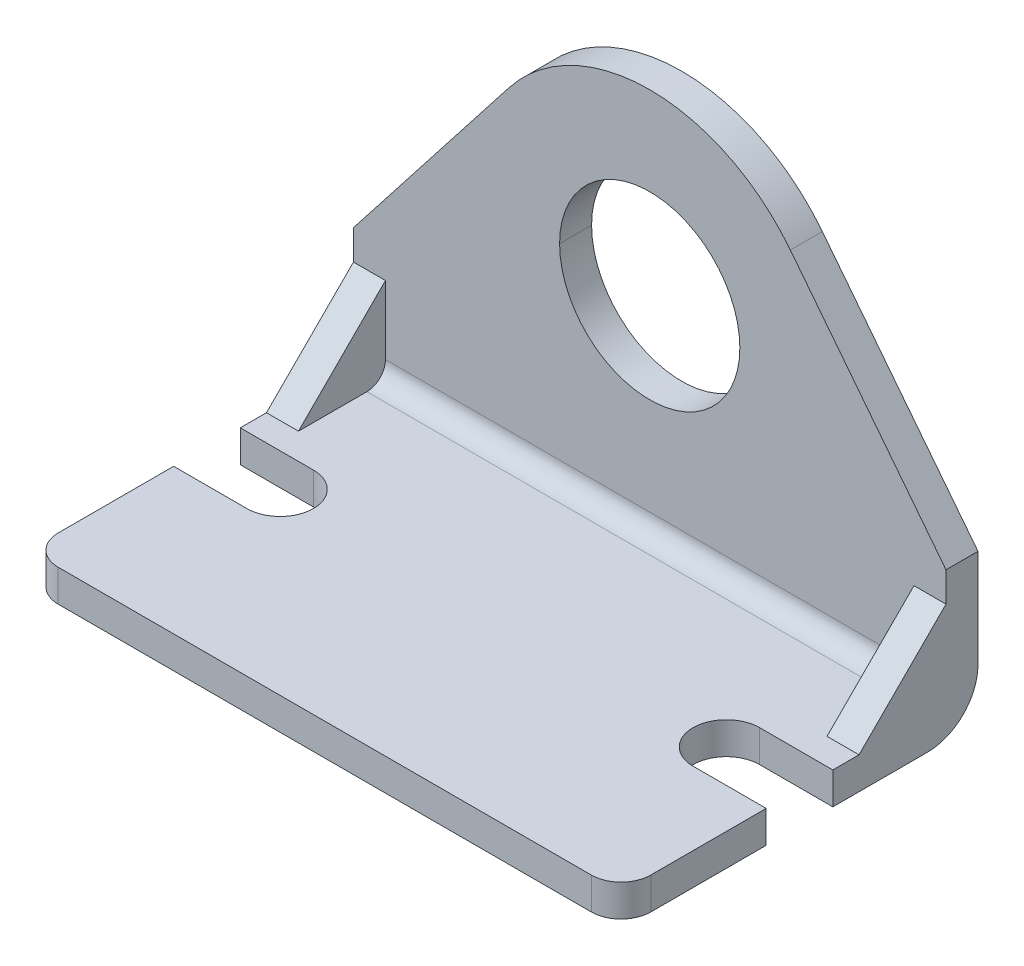
ISO-10303-21;
HEADER;
FILE_DESCRIPTION(('STEP AP214'),'2;1');
FILE_NAME('part.step','',(''),(''),'','','');
FILE_SCHEMA(('AUTOMOTIVE_DESIGN { 1 0 10303 214 1 1 1 1 }'));
ENDSEC;
DATA;
#1=APPLICATION_CONTEXT('core data for automotive mechanical design processes');
#2=APPLICATION_PROTOCOL_DEFINITION('international standard','automotive_design',2000,#1);
#3=PRODUCT_CONTEXT('',#1,'mechanical');
#4=PRODUCT('Part','Part','',(#3));
#5=PRODUCT_RELATED_PRODUCT_CATEGORY('part','',(#4));
#6=PRODUCT_DEFINITION_FORMATION('','',#4);
#7=PRODUCT_DEFINITION_CONTEXT('part definition',#1,'design');
#8=PRODUCT_DEFINITION('design','',#6,#7);
#9=PRODUCT_DEFINITION_SHAPE('','',#8);
#10=(LENGTH_UNIT() NAMED_UNIT(*) SI_UNIT(.MILLI.,.METRE.));
#11=(NAMED_UNIT(*) PLANE_ANGLE_UNIT() SI_UNIT($,.RADIAN.));
#12=(NAMED_UNIT(*) SI_UNIT($,.STERADIAN.) SOLID_ANGLE_UNIT());
#13=UNCERTAINTY_MEASURE_WITH_UNIT(LENGTH_MEASURE(1.E-05),#10,'distance_accuracy_value','');
#14=(GEOMETRIC_REPRESENTATION_CONTEXT(3) GLOBAL_UNCERTAINTY_ASSIGNED_CONTEXT((#13)) GLOBAL_UNIT_ASSIGNED_CONTEXT((#10,
#11,#12)) REPRESENTATION_CONTEXT('',''));
#15=CARTESIAN_POINT('',(0.,0.,0.));
#16=DIRECTION('',(0.,0.,1.));
#17=DIRECTION('',(1.,0.,0.));
#18=AXIS2_PLACEMENT_3D('',#15,#16,#17);
#19=CARTESIAN_POINT('',(63.246,5.39749999999995,5.39749999999995));
#20=DIRECTION('',(1.,0.,0.));
#21=DIRECTION('',(0.,0.707106781186548,0.707106781186548));
#22=AXIS2_PLACEMENT_3D('',#19,#20,#21);
#23=CYLINDRICAL_SURFACE('',#22,1.9812);
#24=CARTESIAN_POINT('',(3.4163,5.39749999999995,5.39749999999995));
#25=DIRECTION('',(1.,0.,0.));
#26=DIRECTION('',(0.,0.,-1.));
#27=AXIS2_PLACEMENT_3D('',#24,#25,#26);
#28=CIRCLE('',#27,1.9812);
#29=CARTESIAN_POINT('',(3.4163,3.4163,5.3975));
#30=VERTEX_POINT('',#29);
#31=CARTESIAN_POINT('',(3.4163,5.39749999999995,3.4163));
#32=VERTEX_POINT('',#31);
#33=EDGE_CURVE('E10',#30,#32,#28,.T.);
#34=ORIENTED_EDGE('',*,*,#33,.F.);
#35=DIRECTION('',(-1.,0.,0.));
#36=VECTOR('',#35,1.);
#37=CARTESIAN_POINT('',(63.246,3.4163,5.3975));
#38=LINE('',#37,#36);
#39=CARTESIAN_POINT('',(59.8297,3.4163,5.3975));
#40=VERTEX_POINT('',#39);
#41=EDGE_CURVE('E24',#40,#30,#38,.T.);
#42=ORIENTED_EDGE('',*,*,#41,.F.);
#43=CARTESIAN_POINT('',(59.8297,5.39749999999995,5.39749999999995));
#44=DIRECTION('',(1.,0.,0.));
#45=DIRECTION('',(0.,0.,-1.));
#46=AXIS2_PLACEMENT_3D('',#43,#44,#45);
#47=CIRCLE('',#46,1.9812);
#48=CARTESIAN_POINT('',(59.8297,5.3975,3.4163));
#49=VERTEX_POINT('',#48);
#50=EDGE_CURVE('E498',#40,#49,#47,.T.);
#51=ORIENTED_EDGE('',*,*,#50,.T.);
#52=DIRECTION('',(-1.,0.,0.));
#53=VECTOR('',#52,1.);
#54=CARTESIAN_POINT('',(63.246,5.3975,3.4163));
#55=LINE('',#54,#53);
#56=EDGE_CURVE('E494',#49,#32,#55,.T.);
#57=ORIENTED_EDGE('',*,*,#56,.T.);
#58=EDGE_LOOP('',(#34,#42,#51,#57));
#59=FACE_BOUND('',#58,.T.);
#60=ADVANCED_FACE('F16',(#59),#23,.F.);
#61=CARTESIAN_POINT('',(63.246,53.34,3.4163));
#62=DIRECTION('',(0.,0.,-1.));
#63=DIRECTION('',(-1.,0.,0.));
#64=AXIS2_PLACEMENT_3D('',#61,#62,#63);
#65=PLANE('',#64);
#66=CARTESIAN_POINT('',(31.623,25.4,3.4163));
#67=DIRECTION('',(0.,0.,-1.));
#68=DIRECTION('',(-1.,0.,0.));
#69=AXIS2_PLACEMENT_3D('',#66,#67,#68);
#70=CIRCLE('',#69,9.62025);
#71=CARTESIAN_POINT('',(22.00275,25.4,3.4163));
#72=VERTEX_POINT('',#71);
#73=CARTESIAN_POINT('',(41.24325,25.4,3.4163));
#74=VERTEX_POINT('',#73);
#75=EDGE_CURVE('E490',#72,#74,#70,.T.);
#76=ORIENTED_EDGE('',*,*,#75,.T.);
#77=CARTESIAN_POINT('',(31.623,25.4,3.4163));
#78=DIRECTION('',(0.,0.,-1.));
#79=DIRECTION('',(-1.,0.,0.));
#80=AXIS2_PLACEMENT_3D('',#77,#78,#79);
#81=CIRCLE('',#80,9.62025);
#82=EDGE_CURVE('E198',#74,#72,#81,.T.);
#83=ORIENTED_EDGE('',*,*,#82,.T.);
#84=EDGE_LOOP('',(#76,#83));
#85=FACE_BOUND('',#84,.T.);
#86=DIRECTION('',(0.,-1.,0.));
#87=VECTOR('',#86,1.);
#88=CARTESIAN_POINT('',(59.8297,53.34,3.4163));
#89=LINE('',#88,#87);
#90=CARTESIAN_POINT('',(59.8297,12.7,3.4163));
#91=VERTEX_POINT('',#90);
#92=EDGE_CURVE('E482',#91,#49,#89,.T.);
#93=ORIENTED_EDGE('',*,*,#92,.F.);
#94=DIRECTION('',(1.,0.,0.));
#95=VECTOR('',#94,1.);
#96=CARTESIAN_POINT('',(59.8297,12.7,3.4163));
#97=LINE('',#96,#95);
#98=CARTESIAN_POINT('',(63.246,12.7,3.4163));
#99=VERTEX_POINT('',#98);
#100=EDGE_CURVE('E478',#91,#99,#97,.T.);
#101=ORIENTED_EDGE('',*,*,#100,.T.);
#102=DIRECTION('',(0.,-1.,0.));
#103=VECTOR('',#102,1.);
#104=CARTESIAN_POINT('',(63.246,53.34,3.4163));
#105=LINE('',#104,#103);
#106=CARTESIAN_POINT('',(63.246,15.8749999999997,3.4163));
#107=VERTEX_POINT('',#106);
#108=EDGE_CURVE('E473',#107,#99,#105,.T.);
#109=ORIENTED_EDGE('',*,*,#108,.F.);
#110=DIRECTION('',(-0.615810103949611,0.787894609623374,0.));
#111=VECTOR('',#110,1.);
#112=CARTESIAN_POINT('',(45.0682269666442,39.1324446182032,3.4163));
#113=LINE('',#112,#111);
#114=CARTESIAN_POINT('',(46.632392313325,37.1311824802399,3.4163));
#115=VERTEX_POINT('',#114);
#116=EDGE_CURVE('E469',#107,#115,#113,.T.);
#117=ORIENTED_EDGE('',*,*,#116,.T.);
#118=CARTESIAN_POINT('',(31.623,25.4000000000008,3.4163));
#119=DIRECTION('',(0.,0.,-1.));
#120=DIRECTION('',(-1.,0.,0.));
#121=AXIS2_PLACEMENT_3D('',#118,#119,#120);
#122=CIRCLE('',#121,19.05);
#123=CARTESIAN_POINT('',(16.613607686675,37.1311824802399,3.4163));
#124=VERTEX_POINT('',#123);
#125=EDGE_CURVE('E464',#124,#115,#122,.T.);
#126=ORIENTED_EDGE('',*,*,#125,.F.);
#127=DIRECTION('',(-0.615810103949611,-0.787894609623374,0.));
#128=VECTOR('',#127,1.);
#129=CARTESIAN_POINT('',(42.162052966016,69.8189902812918,3.4163));
#130=LINE('',#129,#128);
#131=CARTESIAN_POINT('',(0.,15.8749999999997,3.4163));
#132=VERTEX_POINT('',#131);
#133=EDGE_CURVE('E460',#124,#132,#130,.T.);
#134=ORIENTED_EDGE('',*,*,#133,.T.);
#135=DIRECTION('',(0.,-1.,0.));
#136=VECTOR('',#135,1.);
#137=CARTESIAN_POINT('',(0.,53.34,3.4163));
#138=LINE('',#137,#136);
#139=CARTESIAN_POINT('',(0.,12.7,3.4163));
#140=VERTEX_POINT('',#139);
#141=EDGE_CURVE('E456',#132,#140,#138,.T.);
#142=ORIENTED_EDGE('',*,*,#141,.T.);
#143=DIRECTION('',(-1.,0.,0.));
#144=VECTOR('',#143,1.);
#145=CARTESIAN_POINT('',(3.4163,12.7,3.4163));
#146=LINE('',#145,#144);
#147=CARTESIAN_POINT('',(3.4163,12.7,3.4163));
#148=VERTEX_POINT('',#147);
#149=EDGE_CURVE('E451',#148,#140,#146,.T.);
#150=ORIENTED_EDGE('',*,*,#149,.F.);
#151=DIRECTION('',(0.,-1.,0.));
#152=VECTOR('',#151,1.);
#153=CARTESIAN_POINT('',(3.4163,53.34,3.4163));
#154=LINE('',#153,#152);
#155=EDGE_CURVE('E446',#148,#32,#154,.T.);
#156=ORIENTED_EDGE('',*,*,#155,.T.);
#157=ORIENTED_EDGE('',*,*,#56,.F.);
#158=EDGE_LOOP('',(#93,#101,#109,#117,#126,#134,#142,#150,#156,#157));
#159=FACE_BOUND('',#158,.T.);
#160=ADVANCED_FACE('F515',(#85,#159),#65,.F.);
#161=CARTESIAN_POINT('',(3.4163,5.39749999999997,5.39749999999997));
#162=DIRECTION('',(1.,0.,0.));
#163=DIRECTION('',(0.,0.,-1.));
#164=AXIS2_PLACEMENT_3D('',#161,#162,#163);
#165=PLANE('',#164);
#166=DIRECTION('',(0.,0.,1.));
#167=VECTOR('',#166,1.);
#168=CARTESIAN_POINT('',(3.4163,3.4163,5.3975));
#169=LINE('',#168,#167);
#170=CARTESIAN_POINT('',(3.4163,3.4163,12.7));
#171=VERTEX_POINT('',#170);
#172=EDGE_CURVE('E441',#30,#171,#169,.T.);
#173=ORIENTED_EDGE('',*,*,#172,.F.);
#174=ORIENTED_EDGE('',*,*,#33,.T.);
#175=ORIENTED_EDGE('',*,*,#155,.F.);
#176=DIRECTION('',(0.,-0.707106781186548,0.707106781186548));
#177=VECTOR('',#176,1.);
#178=CARTESIAN_POINT('',(3.4163,12.7,3.4163));
#179=LINE('',#178,#177);
#180=EDGE_CURVE('E437',#148,#171,#179,.T.);
#181=ORIENTED_EDGE('',*,*,#180,.T.);
#182=EDGE_LOOP('',(#173,#174,#175,#181));
#183=FACE_BOUND('',#182,.T.);
#184=ADVANCED_FACE('F520',(#183),#165,.T.);
#185=CARTESIAN_POINT('',(3.4163,12.7,3.4163));
#186=DIRECTION('',(0.,-0.707106781186548,-0.707106781186548));
#187=DIRECTION('',(0.,0.707106781186548,-0.707106781186548));
#188=AXIS2_PLACEMENT_3D('',#185,#186,#187);
#189=PLANE('',#188);
#190=DIRECTION('',(0.,-0.707106781186548,0.707106781186548));
#191=VECTOR('',#190,1.);
#192=CARTESIAN_POINT('',(0.,12.7,3.4163));
#193=LINE('',#192,#191);
#194=CARTESIAN_POINT('',(0.,3.4163,12.7));
#195=VERTEX_POINT('',#194);
#196=EDGE_CURVE('E433',#140,#195,#193,.T.);
#197=ORIENTED_EDGE('',*,*,#196,.T.);
#198=DIRECTION('',(-1.,0.,0.));
#199=VECTOR('',#198,1.);
#200=CARTESIAN_POINT('',(3.4163,3.4163,12.7));
#201=LINE('',#200,#199);
#202=EDGE_CURVE('E428',#171,#195,#201,.T.);
#203=ORIENTED_EDGE('',*,*,#202,.F.);
#204=ORIENTED_EDGE('',*,*,#180,.F.);
#205=ORIENTED_EDGE('',*,*,#149,.T.);
#206=EDGE_LOOP('',(#197,#203,#204,#205));
#207=FACE_BOUND('',#206,.T.);
#208=ADVANCED_FACE('F523',(#207),#189,.F.);
#209=CARTESIAN_POINT('',(63.246,3.4163,5.3975));
#210=DIRECTION('',(0.,-1.,0.));
#211=DIRECTION('',(0.,0.,-1.));
#212=AXIS2_PLACEMENT_3D('',#209,#210,#211);
#213=PLANE('',#212);
#214=DIRECTION('',(0.,0.,1.));
#215=VECTOR('',#214,1.);
#216=CARTESIAN_POINT('',(63.246,3.4163,5.3975));
#217=LINE('',#216,#215);
#218=CARTESIAN_POINT('',(63.246,3.4163,12.7));
#219=VERTEX_POINT('',#218);
#220=CARTESIAN_POINT('',(63.246,3.4163,15.494));
#221=VERTEX_POINT('',#220);
#222=EDGE_CURVE('E423',#219,#221,#217,.T.);
#223=ORIENTED_EDGE('',*,*,#222,.F.);
#224=DIRECTION('',(1.,0.,0.));
#225=VECTOR('',#224,1.);
#226=CARTESIAN_POINT('',(59.8297,3.4163,12.7));
#227=LINE('',#226,#225);
#228=CARTESIAN_POINT('',(59.8297,3.4163,12.7));
#229=VERTEX_POINT('',#228);
#230=EDGE_CURVE('E418',#229,#219,#227,.T.);
#231=ORIENTED_EDGE('',*,*,#230,.F.);
#232=DIRECTION('',(0.,0.,1.));
#233=VECTOR('',#232,1.);
#234=CARTESIAN_POINT('',(59.8297,3.4163,5.3975));
#235=LINE('',#234,#233);
#236=EDGE_CURVE('E413',#40,#229,#235,.T.);
#237=ORIENTED_EDGE('',*,*,#236,.F.);
#238=ORIENTED_EDGE('',*,*,#41,.T.);
#239=ORIENTED_EDGE('',*,*,#172,.T.);
#240=ORIENTED_EDGE('',*,*,#202,.T.);
#241=DIRECTION('',(0.,0.,1.));
#242=VECTOR('',#241,1.);
#243=CARTESIAN_POINT('',(0.,3.4163,5.3975));
#244=LINE('',#243,#242);
#245=CARTESIAN_POINT('',(0.,3.4163,15.494));
#246=VERTEX_POINT('',#245);
#247=EDGE_CURVE('E409',#195,#246,#244,.T.);
#248=ORIENTED_EDGE('',*,*,#247,.T.);
#249=DIRECTION('',(-1.,0.,0.));
#250=VECTOR('',#249,1.);
#251=CARTESIAN_POINT('',(63.246,3.4163,15.494));
#252=LINE('',#251,#250);
#253=CARTESIAN_POINT('',(7.8105,3.4163,15.494));
#254=VERTEX_POINT('',#253);
#255=EDGE_CURVE('E404',#254,#246,#252,.T.);
#256=ORIENTED_EDGE('',*,*,#255,.F.);
#257=CARTESIAN_POINT('',(7.8105,3.4163,19.05));
#258=DIRECTION('',(0.,-1.,0.));
#259=DIRECTION('',(0.,0.,-1.));
#260=AXIS2_PLACEMENT_3D('',#257,#258,#259);
#261=CIRCLE('',#260,3.556);
#262=CARTESIAN_POINT('',(7.8105,3.4163,22.606));
#263=VERTEX_POINT('',#262);
#264=EDGE_CURVE('E400',#254,#263,#261,.T.);
#265=ORIENTED_EDGE('',*,*,#264,.T.);
#266=DIRECTION('',(1.,0.,0.));
#267=VECTOR('',#266,1.);
#268=CARTESIAN_POINT('',(63.246,3.4163,22.606));
#269=LINE('',#268,#267);
#270=CARTESIAN_POINT('',(0.,3.4163,22.606));
#271=VERTEX_POINT('',#270);
#272=EDGE_CURVE('E395',#271,#263,#269,.T.);
#273=ORIENTED_EDGE('',*,*,#272,.F.);
#274=DIRECTION('',(0.,0.,1.));
#275=VECTOR('',#274,1.);
#276=CARTESIAN_POINT('',(0.,3.4163,5.3975));
#277=LINE('',#276,#275);
#278=CARTESIAN_POINT('',(0.,3.4163,34.925));
#279=VERTEX_POINT('',#278);
#280=EDGE_CURVE('E391',#271,#279,#277,.T.);
#281=ORIENTED_EDGE('',*,*,#280,.T.);
#282=CARTESIAN_POINT('',(3.17500000000051,3.4163,34.9249999999995));
#283=DIRECTION('',(0.,-1.,0.));
#284=DIRECTION('',(0.,0.,-1.));
#285=AXIS2_PLACEMENT_3D('',#282,#283,#284);
#286=CIRCLE('',#285,3.175);
#287=CARTESIAN_POINT('',(3.175,3.4163,38.1));
#288=VERTEX_POINT('',#287);
#289=EDGE_CURVE('E386',#288,#279,#286,.T.);
#290=ORIENTED_EDGE('',*,*,#289,.F.);
#291=DIRECTION('',(-1.,0.,0.));
#292=VECTOR('',#291,1.);
#293=CARTESIAN_POINT('',(63.246,3.4163,38.1));
#294=LINE('',#293,#292);
#295=CARTESIAN_POINT('',(60.071,3.4163,38.1));
#296=VERTEX_POINT('',#295);
#297=EDGE_CURVE('E381',#296,#288,#294,.T.);
#298=ORIENTED_EDGE('',*,*,#297,.F.);
#299=CARTESIAN_POINT('',(60.070999999999,3.4163,34.924999999999));
#300=DIRECTION('',(0.,-1.,0.));
#301=DIRECTION('',(0.,0.,-1.));
#302=AXIS2_PLACEMENT_3D('',#299,#300,#301);
#303=CIRCLE('',#302,3.175);
#304=CARTESIAN_POINT('',(63.246,3.4163,34.925));
#305=VERTEX_POINT('',#304);
#306=EDGE_CURVE('E376',#305,#296,#303,.T.);
#307=ORIENTED_EDGE('',*,*,#306,.F.);
#308=DIRECTION('',(0.,0.,1.));
#309=VECTOR('',#308,1.);
#310=CARTESIAN_POINT('',(63.246,3.4163,5.3975));
#311=LINE('',#310,#309);
#312=CARTESIAN_POINT('',(63.246,3.4163,22.606));
#313=VERTEX_POINT('',#312);
#314=EDGE_CURVE('E371',#313,#305,#311,.T.);
#315=ORIENTED_EDGE('',*,*,#314,.F.);
#316=DIRECTION('',(1.,0.,0.));
#317=VECTOR('',#316,1.);
#318=CARTESIAN_POINT('',(63.246,3.4163,22.606));
#319=LINE('',#318,#317);
#320=CARTESIAN_POINT('',(55.4355,3.4163,22.606));
#321=VERTEX_POINT('',#320);
#322=EDGE_CURVE('E366',#321,#313,#319,.T.);
#323=ORIENTED_EDGE('',*,*,#322,.F.);
#324=CARTESIAN_POINT('',(55.4355,3.4163,19.05));
#325=DIRECTION('',(0.,-1.,0.));
#326=DIRECTION('',(0.,0.,-1.));
#327=AXIS2_PLACEMENT_3D('',#324,#325,#326);
#328=CIRCLE('',#327,3.556);
#329=CARTESIAN_POINT('',(55.4355,3.4163,15.494));
#330=VERTEX_POINT('',#329);
#331=EDGE_CURVE('E362',#321,#330,#328,.T.);
#332=ORIENTED_EDGE('',*,*,#331,.T.);
#333=DIRECTION('',(-1.,0.,0.));
#334=VECTOR('',#333,1.);
#335=CARTESIAN_POINT('',(63.246,3.4163,15.494));
#336=LINE('',#335,#334);
#337=EDGE_CURVE('E357',#221,#330,#336,.T.);
#338=ORIENTED_EDGE('',*,*,#337,.F.);
#339=EDGE_LOOP('',(#223,#231,#237,#238,#239,#240,#248,#256,#265,#273,#281,#290,#298,#307,#315,
#323,#332,#338));
#340=FACE_BOUND('',#339,.T.);
#341=ADVANCED_FACE('F507',(#340),#213,.F.);
#342=CARTESIAN_POINT('',(69.5706,5.12445,15.494));
#343=DIRECTION('',(0.,0.,1.));
#344=DIRECTION('',(1.,0.,0.));
#345=AXIS2_PLACEMENT_3D('',#342,#343,#344);
#346=PLANE('',#345);
#347=ORIENTED_EDGE('',*,*,#337,.T.);
#348=DIRECTION('',(0.,-1.,0.));
#349=VECTOR('',#348,1.);
#350=CARTESIAN_POINT('',(55.4355,5.12445,15.494));
#351=LINE('',#350,#349);
#352=CARTESIAN_POINT('',(55.4355,0.,15.494));
#353=VERTEX_POINT('',#352);
#354=EDGE_CURVE('E353',#330,#353,#351,.T.);
#355=ORIENTED_EDGE('',*,*,#354,.T.);
#356=DIRECTION('',(-1.,0.,0.));
#357=VECTOR('',#356,1.);
#358=CARTESIAN_POINT('',(69.5706,0.,15.494));
#359=LINE('',#358,#357);
#360=CARTESIAN_POINT('',(63.246,0.,15.494));
#361=VERTEX_POINT('',#360);
#362=EDGE_CURVE('E348',#361,#353,#359,.T.);
#363=ORIENTED_EDGE('',*,*,#362,.F.);
#364=DIRECTION('',(0.,-1.,0.));
#365=VECTOR('',#364,1.);
#366=CARTESIAN_POINT('',(63.246,5.39749999999997,15.494));
#367=LINE('',#366,#365);
#368=EDGE_CURVE('E343',#221,#361,#367,.T.);
#369=ORIENTED_EDGE('',*,*,#368,.F.);
#370=EDGE_LOOP('',(#347,#355,#363,#369));
#371=FACE_BOUND('',#370,.T.);
#372=ADVANCED_FACE('F590',(#371),#346,.T.);
#373=CARTESIAN_POINT('',(63.246,5.39749999999997,5.39749999999997));
#374=DIRECTION('',(1.,0.,0.));
#375=DIRECTION('',(0.,0.,-1.));
#376=AXIS2_PLACEMENT_3D('',#373,#374,#375);
#377=PLANE('',#376);
#378=DIRECTION('',(0.,-0.707106781186548,0.707106781186548));
#379=VECTOR('',#378,1.);
#380=CARTESIAN_POINT('',(63.246,12.7,3.4163));
#381=LINE('',#380,#379);
#382=EDGE_CURVE('E338',#99,#219,#381,.T.);
#383=ORIENTED_EDGE('',*,*,#382,.T.);
#384=ORIENTED_EDGE('',*,*,#222,.T.);
#385=ORIENTED_EDGE('',*,*,#368,.T.);
#386=DIRECTION('',(0.,0.,-1.));
#387=VECTOR('',#386,1.);
#388=CARTESIAN_POINT('',(63.246,0.,38.1));
#389=LINE('',#388,#387);
#390=CARTESIAN_POINT('',(63.246,0.,5.3975));
#391=VERTEX_POINT('',#390);
#392=EDGE_CURVE('E334',#361,#391,#389,.T.);
#393=ORIENTED_EDGE('',*,*,#392,.T.);
#394=CARTESIAN_POINT('',(63.246,5.39749999999997,5.39749999999997));
#395=DIRECTION('',(1.,0.,0.));
#396=DIRECTION('',(0.,0.,-1.));
#397=AXIS2_PLACEMENT_3D('',#394,#395,#396);
#398=CIRCLE('',#397,5.3975);
#399=CARTESIAN_POINT('',(63.246,5.3975,0.));
#400=VERTEX_POINT('',#399);
#401=EDGE_CURVE('E330',#391,#400,#398,.T.);
#402=ORIENTED_EDGE('',*,*,#401,.T.);
#403=DIRECTION('',(0.,1.,0.));
#404=VECTOR('',#403,1.);
#405=CARTESIAN_POINT('',(63.246,5.3975,0.));
#406=LINE('',#405,#404);
#407=CARTESIAN_POINT('',(63.246,15.8749999999997,0.));
#408=VERTEX_POINT('',#407);
#409=EDGE_CURVE('E326',#400,#408,#406,.T.);
#410=ORIENTED_EDGE('',*,*,#409,.T.);
#411=DIRECTION('',(0.,0.,-1.));
#412=VECTOR('',#411,1.);
#413=CARTESIAN_POINT('',(63.246,15.8749999999997,5.39749999999997));
#414=LINE('',#413,#412);
#415=EDGE_CURVE('E321',#107,#408,#414,.T.);
#416=ORIENTED_EDGE('',*,*,#415,.F.);
#417=ORIENTED_EDGE('',*,*,#108,.T.);
#418=EDGE_LOOP('',(#383,#384,#385,#393,#402,#410,#416,#417));
#419=FACE_BOUND('',#418,.T.);
#420=ADVANCED_FACE('F593',(#419),#377,.T.);
#421=CARTESIAN_POINT('',(75.6537323042899,0.,5.12445));
#422=DIRECTION('',(-0.787894609623374,-0.615810103949611,0.));
#423=DIRECTION('',(0.615810103949611,-0.787894609623374,0.));
#424=AXIS2_PLACEMENT_3D('',#421,#422,#423);
#425=PLANE('',#424);
#426=ORIENTED_EDGE('',*,*,#415,.T.);
#427=DIRECTION('',(-0.615810103949611,0.787894609623374,0.));
#428=VECTOR('',#427,1.);
#429=CARTESIAN_POINT('',(75.6537323042899,0.,0.));
#430=LINE('',#429,#428);
#431=CARTESIAN_POINT('',(46.632392313325,37.1311824802399,0.));
#432=VERTEX_POINT('',#431);
#433=EDGE_CURVE('E317',#408,#432,#430,.T.);
#434=ORIENTED_EDGE('',*,*,#433,.T.);
#435=DIRECTION('',(0.,0.,-1.));
#436=VECTOR('',#435,1.);
#437=CARTESIAN_POINT('',(46.632392313325,37.1311824802399,5.12445));
#438=LINE('',#437,#436);
#439=EDGE_CURVE('E312',#115,#432,#438,.T.);
#440=ORIENTED_EDGE('',*,*,#439,.F.);
#441=ORIENTED_EDGE('',*,*,#116,.F.);
#442=EDGE_LOOP('',(#426,#434,#440,#441));
#443=FACE_BOUND('',#442,.T.);
#444=ADVANCED_FACE('F639',(#443),#425,.F.);
#445=CARTESIAN_POINT('',(31.623,25.4000000000008,5.12445));
#446=DIRECTION('',(0.,0.,1.));
#447=DIRECTION('',(0.,-1.,0.));
#448=AXIS2_PLACEMENT_3D('',#445,#446,#447);
#449=CYLINDRICAL_SURFACE('',#448,19.05);
#450=ORIENTED_EDGE('',*,*,#439,.T.);
#451=CARTESIAN_POINT('',(31.623,25.4000000000008,0.));
#452=DIRECTION('',(0.,0.,1.));
#453=DIRECTION('',(1.,0.,0.));
#454=AXIS2_PLACEMENT_3D('',#451,#452,#453);
#455=CIRCLE('',#454,19.05);
#456=CARTESIAN_POINT('',(16.613607686675,37.1311824802399,0.));
#457=VERTEX_POINT('',#456);
#458=EDGE_CURVE('E308',#432,#457,#455,.T.);
#459=ORIENTED_EDGE('',*,*,#458,.T.);
#460=DIRECTION('',(0.,0.,-1.));
#461=VECTOR('',#460,1.);
#462=CARTESIAN_POINT('',(16.613607686675,37.1311824802399,5.12445));
#463=LINE('',#462,#461);
#464=EDGE_CURVE('E303',#124,#457,#463,.T.);
#465=ORIENTED_EDGE('',*,*,#464,.F.);
#466=ORIENTED_EDGE('',*,*,#125,.T.);
#467=EDGE_LOOP('',(#450,#459,#465,#466));
#468=FACE_BOUND('',#467,.T.);
#469=ADVANCED_FACE('F642',(#468),#449,.T.);
#470=CARTESIAN_POINT('',(16.613607686675,37.1311824802399,5.12445));
#471=DIRECTION('',(0.787894609623374,-0.615810103949611,0.));
#472=DIRECTION('',(0.615810103949611,0.787894609623374,0.));
#473=AXIS2_PLACEMENT_3D('',#470,#471,#472);
#474=PLANE('',#473);
#475=ORIENTED_EDGE('',*,*,#464,.T.);
#476=DIRECTION('',(-0.615810103949611,-0.787894609623374,0.));
#477=VECTOR('',#476,1.);
#478=CARTESIAN_POINT('',(16.613607686675,37.1311824802399,0.));
#479=LINE('',#478,#477);
#480=CARTESIAN_POINT('',(0.,15.8749999999997,0.));
#481=VERTEX_POINT('',#480);
#482=EDGE_CURVE('E299',#457,#481,#479,.T.);
#483=ORIENTED_EDGE('',*,*,#482,.T.);
#484=DIRECTION('',(0.,0.,-1.));
#485=VECTOR('',#484,1.);
#486=CARTESIAN_POINT('',(0.,15.8749999999997,5.39749999999997));
#487=LINE('',#486,#485);
#488=EDGE_CURVE('E294',#132,#481,#487,.T.);
#489=ORIENTED_EDGE('',*,*,#488,.F.);
#490=ORIENTED_EDGE('',*,*,#133,.F.);
#491=EDGE_LOOP('',(#475,#483,#489,#490));
#492=FACE_BOUND('',#491,.T.);
#493=ADVANCED_FACE('F646',(#492),#474,.F.);
#494=CARTESIAN_POINT('',(0.,5.39749999999997,5.39749999999997));
#495=DIRECTION('',(1.,0.,0.));
#496=DIRECTION('',(0.,0.,-1.));
#497=AXIS2_PLACEMENT_3D('',#494,#495,#496);
#498=PLANE('',#497);
#499=ORIENTED_EDGE('',*,*,#247,.F.);
#500=ORIENTED_EDGE('',*,*,#196,.F.);
#501=ORIENTED_EDGE('',*,*,#141,.F.);
#502=ORIENTED_EDGE('',*,*,#488,.T.);
#503=DIRECTION('',(0.,1.,0.));
#504=VECTOR('',#503,1.);
#505=CARTESIAN_POINT('',(0.,5.3975,0.));
#506=LINE('',#505,#504);
#507=CARTESIAN_POINT('',(0.,5.3975,0.));
#508=VERTEX_POINT('',#507);
#509=EDGE_CURVE('E289',#508,#481,#506,.T.);
#510=ORIENTED_EDGE('',*,*,#509,.F.);
#511=CARTESIAN_POINT('',(0.,5.39749999999997,5.39749999999997));
#512=DIRECTION('',(1.,0.,0.));
#513=DIRECTION('',(0.,0.,-1.));
#514=AXIS2_PLACEMENT_3D('',#511,#512,#513);
#515=CIRCLE('',#514,5.3975);
#516=CARTESIAN_POINT('',(0.,0.,5.3975));
#517=VERTEX_POINT('',#516);
#518=EDGE_CURVE('E284',#517,#508,#515,.T.);
#519=ORIENTED_EDGE('',*,*,#518,.F.);
#520=DIRECTION('',(0.,0.,-1.));
#521=VECTOR('',#520,1.);
#522=CARTESIAN_POINT('',(0.,0.,38.1));
#523=LINE('',#522,#521);
#524=CARTESIAN_POINT('',(0.,0.,15.494));
#525=VERTEX_POINT('',#524);
#526=EDGE_CURVE('E279',#525,#517,#523,.T.);
#527=ORIENTED_EDGE('',*,*,#526,.F.);
#528=DIRECTION('',(0.,-1.,0.));
#529=VECTOR('',#528,1.);
#530=CARTESIAN_POINT('',(0.,5.39749999999997,15.494));
#531=LINE('',#530,#529);
#532=EDGE_CURVE('E274',#246,#525,#531,.T.);
#533=ORIENTED_EDGE('',*,*,#532,.F.);
#534=EDGE_LOOP('',(#499,#500,#501,#502,#510,#519,#527,#533));
#535=FACE_BOUND('',#534,.T.);
#536=ADVANCED_FACE('F528',(#535),#498,.F.);
#537=CARTESIAN_POINT('',(7.8105,5.12445,15.494));
#538=DIRECTION('',(0.,0.,1.));
#539=DIRECTION('',(1.,0.,0.));
#540=AXIS2_PLACEMENT_3D('',#537,#538,#539);
#541=PLANE('',#540);
#542=ORIENTED_EDGE('',*,*,#255,.T.);
#543=ORIENTED_EDGE('',*,*,#532,.T.);
#544=DIRECTION('',(-1.,0.,0.));
#545=VECTOR('',#544,1.);
#546=CARTESIAN_POINT('',(7.8105,0.,15.494));
#547=LINE('',#546,#545);
#548=CARTESIAN_POINT('',(7.8105,0.,15.494));
#549=VERTEX_POINT('',#548);
#550=EDGE_CURVE('E269',#549,#525,#547,.T.);
#551=ORIENTED_EDGE('',*,*,#550,.F.);
#552=DIRECTION('',(0.,-1.,0.));
#553=VECTOR('',#552,1.);
#554=CARTESIAN_POINT('',(7.8105,5.12445,15.494));
#555=LINE('',#554,#553);
#556=EDGE_CURVE('E264',#254,#549,#555,.T.);
#557=ORIENTED_EDGE('',*,*,#556,.F.);
#558=EDGE_LOOP('',(#542,#543,#551,#557));
#559=FACE_BOUND('',#558,.T.);
#560=ADVANCED_FACE('F532',(#559),#541,.T.);
#561=CARTESIAN_POINT('',(7.8105,5.12445,19.05));
#562=DIRECTION('',(0.,1.,0.));
#563=DIRECTION('',(-1.,0.,0.));
#564=AXIS2_PLACEMENT_3D('',#561,#562,#563);
#565=CYLINDRICAL_SURFACE('',#564,3.556);
#566=DIRECTION('',(0.,-1.,0.));
#567=VECTOR('',#566,1.);
#568=CARTESIAN_POINT('',(7.8105,5.12445,22.606));
#569=LINE('',#568,#567);
#570=CARTESIAN_POINT('',(7.8105,0.,22.606));
#571=VERTEX_POINT('',#570);
#572=EDGE_CURVE('E259',#263,#571,#569,.T.);
#573=ORIENTED_EDGE('',*,*,#572,.F.);
#574=ORIENTED_EDGE('',*,*,#264,.F.);
#575=ORIENTED_EDGE('',*,*,#556,.T.);
#576=CARTESIAN_POINT('',(7.8105,0.,19.05));
#577=DIRECTION('',(0.,1.,0.));
#578=DIRECTION('',(1.,0.,0.));
#579=AXIS2_PLACEMENT_3D('',#576,#577,#578);
#580=CIRCLE('',#579,3.556);
#581=EDGE_CURVE('E254',#571,#549,#580,.T.);
#582=ORIENTED_EDGE('',*,*,#581,.F.);
#583=EDGE_LOOP('',(#573,#574,#575,#582));
#584=FACE_BOUND('',#583,.T.);
#585=ADVANCED_FACE('F537',(#584),#565,.F.);
#586=CARTESIAN_POINT('',(63.246,0.,38.1));
#587=DIRECTION('',(0.,1.,0.));
#588=DIRECTION('',(0.,0.,1.));
#589=AXIS2_PLACEMENT_3D('',#586,#587,#588);
#590=PLANE('',#589);
#591=ORIENTED_EDGE('',*,*,#362,.T.);
#592=CARTESIAN_POINT('',(55.4355,0.,19.05));
#593=DIRECTION('',(0.,1.,0.));
#594=DIRECTION('',(1.,0.,0.));
#595=AXIS2_PLACEMENT_3D('',#592,#593,#594);
#596=CIRCLE('',#595,3.556);
#597=CARTESIAN_POINT('',(55.4355,0.,22.606));
#598=VERTEX_POINT('',#597);
#599=EDGE_CURVE('E250',#353,#598,#596,.T.);
#600=ORIENTED_EDGE('',*,*,#599,.T.);
#601=DIRECTION('',(1.,0.,0.));
#602=VECTOR('',#601,1.);
#603=CARTESIAN_POINT('',(55.4355,0.,22.606));
#604=LINE('',#603,#602);
#605=CARTESIAN_POINT('',(63.246,0.,22.606));
#606=VERTEX_POINT('',#605);
#607=EDGE_CURVE('E246',#598,#606,#604,.T.);
#608=ORIENTED_EDGE('',*,*,#607,.T.);
#609=DIRECTION('',(0.,0.,-1.));
#610=VECTOR('',#609,1.);
#611=CARTESIAN_POINT('',(63.246,0.,38.1));
#612=LINE('',#611,#610);
#613=CARTESIAN_POINT('',(63.246,0.,34.925));
#614=VERTEX_POINT('',#613);
#615=EDGE_CURVE('E241',#614,#606,#612,.T.);
#616=ORIENTED_EDGE('',*,*,#615,.F.);
#617=CARTESIAN_POINT('',(60.070999999999,0.,34.924999999999));
#618=DIRECTION('',(0.,1.,0.));
#619=DIRECTION('',(1.,0.,0.));
#620=AXIS2_PLACEMENT_3D('',#617,#618,#619);
#621=CIRCLE('',#620,3.175);
#622=CARTESIAN_POINT('',(60.071,0.,38.1));
#623=VERTEX_POINT('',#622);
#624=EDGE_CURVE('E236',#623,#614,#621,.T.);
#625=ORIENTED_EDGE('',*,*,#624,.F.);
#626=DIRECTION('',(-1.,0.,0.));
#627=VECTOR('',#626,1.);
#628=CARTESIAN_POINT('',(63.246,0.,38.1));
#629=LINE('',#628,#627);
#630=CARTESIAN_POINT('',(3.175,0.,38.1));
#631=VERTEX_POINT('',#630);
#632=EDGE_CURVE('E232',#623,#631,#629,.T.);
#633=ORIENTED_EDGE('',*,*,#632,.T.);
#634=CARTESIAN_POINT('',(3.17500000000051,0.,34.9249999999995));
#635=DIRECTION('',(0.,1.,0.));
#636=DIRECTION('',(1.,0.,0.));
#637=AXIS2_PLACEMENT_3D('',#634,#635,#636);
#638=CIRCLE('',#637,3.175);
#639=CARTESIAN_POINT('',(0.,0.,34.925));
#640=VERTEX_POINT('',#639);
#641=EDGE_CURVE('E227',#640,#631,#638,.T.);
#642=ORIENTED_EDGE('',*,*,#641,.F.);
#643=DIRECTION('',(0.,0.,-1.));
#644=VECTOR('',#643,1.);
#645=CARTESIAN_POINT('',(0.,0.,38.1));
#646=LINE('',#645,#644);
#647=CARTESIAN_POINT('',(0.,0.,22.606));
#648=VERTEX_POINT('',#647);
#649=EDGE_CURVE('E223',#640,#648,#646,.T.);
#650=ORIENTED_EDGE('',*,*,#649,.T.);
#651=DIRECTION('',(1.,0.,0.));
#652=VECTOR('',#651,1.);
#653=CARTESIAN_POINT('',(-6.3246,0.,22.606));
#654=LINE('',#653,#652);
#655=EDGE_CURVE('E218',#648,#571,#654,.T.);
#656=ORIENTED_EDGE('',*,*,#655,.T.);
#657=ORIENTED_EDGE('',*,*,#581,.T.);
#658=ORIENTED_EDGE('',*,*,#550,.T.);
#659=ORIENTED_EDGE('',*,*,#526,.T.);
#660=DIRECTION('',(-1.,0.,0.));
#661=VECTOR('',#660,1.);
#662=CARTESIAN_POINT('',(63.246,0.,5.3975));
#663=LINE('',#662,#661);
#664=EDGE_CURVE('E207',#391,#517,#663,.T.);
#665=ORIENTED_EDGE('',*,*,#664,.F.);
#666=ORIENTED_EDGE('',*,*,#392,.F.);
#667=EDGE_LOOP('',(#591,#600,#608,#616,#625,#633,#642,#650,#656,#657,#658,#659,#665,#666));
#668=FACE_BOUND('',#667,.T.);
#669=ADVANCED_FACE('F657',(#668),#590,.F.);
#670=CARTESIAN_POINT('',(63.246,5.39749999999997,5.39749999999997));
#671=DIRECTION('',(1.,0.,0.));
#672=DIRECTION('',(0.,0.707106781186548,0.707106781186547));
#673=AXIS2_PLACEMENT_3D('',#670,#671,#672);
#674=CYLINDRICAL_SURFACE('',#673,5.3975);
#675=ORIENTED_EDGE('',*,*,#518,.T.);
#676=DIRECTION('',(-1.,0.,0.));
#677=VECTOR('',#676,1.);
#678=CARTESIAN_POINT('',(63.246,5.3975,0.));
#679=LINE('',#678,#677);
#680=EDGE_CURVE('E204',#400,#508,#679,.T.);
#681=ORIENTED_EDGE('',*,*,#680,.F.);
#682=ORIENTED_EDGE('',*,*,#401,.F.);
#683=ORIENTED_EDGE('',*,*,#664,.T.);
#684=EDGE_LOOP('',(#675,#681,#682,#683));
#685=FACE_BOUND('',#684,.T.);
#686=ADVANCED_FACE('F660',(#685),#674,.T.);
#687=CARTESIAN_POINT('',(63.246,5.3975,0.));
#688=DIRECTION('',(0.,0.,1.));
#689=DIRECTION('',(1.,0.,0.));
#690=AXIS2_PLACEMENT_3D('',#687,#688,#689);
#691=PLANE('',#690);
#692=CARTESIAN_POINT('',(31.623,25.4,0.));
#693=DIRECTION('',(0.,0.,1.));
#694=DIRECTION('',(1.,0.,0.));
#695=AXIS2_PLACEMENT_3D('',#692,#693,#694);
#696=CIRCLE('',#695,9.62025);
#697=CARTESIAN_POINT('',(41.24325,25.4,0.));
#698=VERTEX_POINT('',#697);
#699=CARTESIAN_POINT('',(22.00275,25.4,0.));
#700=VERTEX_POINT('',#699);
#701=EDGE_CURVE('E189',#698,#700,#696,.T.);
#702=ORIENTED_EDGE('',*,*,#701,.T.);
#703=CARTESIAN_POINT('',(31.623,25.4,0.));
#704=DIRECTION('',(0.,0.,1.));
#705=DIRECTION('',(1.,0.,0.));
#706=AXIS2_PLACEMENT_3D('',#703,#704,#705);
#707=CIRCLE('',#706,9.62025);
#708=EDGE_CURVE('E184',#700,#698,#707,.T.);
#709=ORIENTED_EDGE('',*,*,#708,.T.);
#710=EDGE_LOOP('',(#702,#709));
#711=FACE_BOUND('',#710,.T.);
#712=ORIENTED_EDGE('',*,*,#509,.T.);
#713=ORIENTED_EDGE('',*,*,#482,.F.);
#714=ORIENTED_EDGE('',*,*,#458,.F.);
#715=ORIENTED_EDGE('',*,*,#433,.F.);
#716=ORIENTED_EDGE('',*,*,#409,.F.);
#717=ORIENTED_EDGE('',*,*,#680,.T.);
#718=EDGE_LOOP('',(#712,#713,#714,#715,#716,#717));
#719=FACE_BOUND('',#718,.T.);
#720=ADVANCED_FACE('F186',(#711,#719),#691,.F.);
#721=CARTESIAN_POINT('',(31.623,25.4,5.12445));
#722=DIRECTION('',(0.,0.,1.));
#723=DIRECTION('',(0.,1.,0.));
#724=AXIS2_PLACEMENT_3D('',#721,#722,#723);
#725=CYLINDRICAL_SURFACE('',#724,9.62025);
#726=ORIENTED_EDGE('',*,*,#82,.F.);
#727=DIRECTION('',(0.,0.,1.));
#728=VECTOR('',#727,1.);
#729=CARTESIAN_POINT('',(41.24325,25.4,0.));
#730=LINE('',#729,#728);
#731=EDGE_CURVE('E193',#698,#74,#730,.T.);
#732=ORIENTED_EDGE('',*,*,#731,.F.);
#733=ORIENTED_EDGE('',*,*,#708,.F.);
#734=DIRECTION('',(0.,0.,1.));
#735=VECTOR('',#734,1.);
#736=CARTESIAN_POINT('',(22.00275,25.4,0.));
#737=LINE('',#736,#735);
#738=EDGE_CURVE('E201',#700,#72,#737,.T.);
#739=ORIENTED_EDGE('',*,*,#738,.T.);
#740=EDGE_LOOP('',(#726,#732,#733,#739));
#741=FACE_BOUND('',#740,.T.);
#742=ADVANCED_FACE('F197',(#741),#725,.F.);
#743=CARTESIAN_POINT('',(31.623,25.4,5.12445));
#744=DIRECTION('',(0.,0.,1.));
#745=DIRECTION('',(0.,-1.,0.));
#746=AXIS2_PLACEMENT_3D('',#743,#744,#745);
#747=CYLINDRICAL_SURFACE('',#746,9.62025);
#748=ORIENTED_EDGE('',*,*,#701,.F.);
#749=ORIENTED_EDGE('',*,*,#731,.T.);
#750=ORIENTED_EDGE('',*,*,#75,.F.);
#751=ORIENTED_EDGE('',*,*,#738,.F.);
#752=EDGE_LOOP('',(#748,#749,#750,#751));
#753=FACE_BOUND('',#752,.T.);
#754=ADVANCED_FACE('F203',(#753),#747,.F.);
#755=CARTESIAN_POINT('',(-6.3246,5.12445,22.606));
#756=DIRECTION('',(0.,0.,-1.));
#757=DIRECTION('',(-1.,0.,0.));
#758=AXIS2_PLACEMENT_3D('',#755,#756,#757);
#759=PLANE('',#758);
#760=ORIENTED_EDGE('',*,*,#272,.T.);
#761=ORIENTED_EDGE('',*,*,#572,.T.);
#762=ORIENTED_EDGE('',*,*,#655,.F.);
#763=DIRECTION('',(0.,1.,0.));
#764=VECTOR('',#763,1.);
#765=CARTESIAN_POINT('',(0.,5.39749999999997,22.606));
#766=LINE('',#765,#764);
#767=EDGE_CURVE('E542',#648,#271,#766,.T.);
#768=ORIENTED_EDGE('',*,*,#767,.T.);
#769=EDGE_LOOP('',(#760,#761,#762,#768));
#770=FACE_BOUND('',#769,.T.);
#771=ADVANCED_FACE('F540',(#770),#759,.T.);
#772=CARTESIAN_POINT('',(0.,5.39749999999997,5.39749999999997));
#773=DIRECTION('',(1.,0.,0.));
#774=DIRECTION('',(0.,0.,-1.));
#775=AXIS2_PLACEMENT_3D('',#772,#773,#774);
#776=PLANE('',#775);
#777=ORIENTED_EDGE('',*,*,#767,.F.);
#778=ORIENTED_EDGE('',*,*,#649,.F.);
#779=DIRECTION('',(0.,-1.,0.));
#780=VECTOR('',#779,1.);
#781=CARTESIAN_POINT('',(0.,5.39749999999997,34.925));
#782=LINE('',#781,#780);
#783=EDGE_CURVE('E546',#279,#640,#782,.T.);
#784=ORIENTED_EDGE('',*,*,#783,.F.);
#785=ORIENTED_EDGE('',*,*,#280,.F.);
#786=EDGE_LOOP('',(#777,#778,#784,#785));
#787=FACE_BOUND('',#786,.T.);
#788=ADVANCED_FACE('F549',(#787),#776,.F.);
#789=CARTESIAN_POINT('',(3.17500000000051,5.12445,34.9249999999995));
#790=DIRECTION('',(0.,1.,0.));
#791=DIRECTION('',(0.707106781186548,0.,-0.707106781186547));
#792=AXIS2_PLACEMENT_3D('',#789,#790,#791);
#793=CYLINDRICAL_SURFACE('',#792,3.175);
#794=ORIENTED_EDGE('',*,*,#783,.T.);
#795=ORIENTED_EDGE('',*,*,#641,.T.);
#796=DIRECTION('',(0.,-1.,0.));
#797=VECTOR('',#796,1.);
#798=CARTESIAN_POINT('',(3.175,5.12445,38.1));
#799=LINE('',#798,#797);
#800=EDGE_CURVE('E555',#288,#631,#799,.T.);
#801=ORIENTED_EDGE('',*,*,#800,.F.);
#802=ORIENTED_EDGE('',*,*,#289,.T.);
#803=EDGE_LOOP('',(#794,#795,#801,#802));
#804=FACE_BOUND('',#803,.T.);
#805=ADVANCED_FACE('F556',(#804),#793,.T.);
#806=CARTESIAN_POINT('',(63.246,3.4163,38.1));
#807=DIRECTION('',(0.,0.,-1.));
#808=DIRECTION('',(-1.,0.,0.));
#809=AXIS2_PLACEMENT_3D('',#806,#807,#808);
#810=PLANE('',#809);
#811=DIRECTION('',(0.,-1.,0.));
#812=VECTOR('',#811,1.);
#813=CARTESIAN_POINT('',(60.071,5.12445,38.1));
#814=LINE('',#813,#812);
#815=EDGE_CURVE('E559',#296,#623,#814,.T.);
#816=ORIENTED_EDGE('',*,*,#815,.F.);
#817=ORIENTED_EDGE('',*,*,#297,.T.);
#818=ORIENTED_EDGE('',*,*,#800,.T.);
#819=ORIENTED_EDGE('',*,*,#632,.F.);
#820=EDGE_LOOP('',(#816,#817,#818,#819));
#821=FACE_BOUND('',#820,.T.);
#822=ADVANCED_FACE('F561',(#821),#810,.F.);
#823=CARTESIAN_POINT('',(60.070999999999,5.12445,34.924999999999));
#824=DIRECTION('',(0.,1.,0.));
#825=DIRECTION('',(-0.707106781186662,0.,-0.707106781186433));
#826=AXIS2_PLACEMENT_3D('',#823,#824,#825);
#827=CYLINDRICAL_SURFACE('',#826,3.175);
#828=ORIENTED_EDGE('',*,*,#815,.T.);
#829=ORIENTED_EDGE('',*,*,#624,.T.);
#830=DIRECTION('',(0.,-1.,0.));
#831=VECTOR('',#830,1.);
#832=CARTESIAN_POINT('',(63.246,5.39749999999997,34.925));
#833=LINE('',#832,#831);
#834=EDGE_CURVE('E564',#305,#614,#833,.T.);
#835=ORIENTED_EDGE('',*,*,#834,.F.);
#836=ORIENTED_EDGE('',*,*,#306,.T.);
#837=EDGE_LOOP('',(#828,#829,#835,#836));
#838=FACE_BOUND('',#837,.T.);
#839=ADVANCED_FACE('F567',(#838),#827,.T.);
#840=CARTESIAN_POINT('',(63.246,5.39749999999997,5.39749999999997));
#841=DIRECTION('',(1.,0.,0.));
#842=DIRECTION('',(0.,0.,-1.));
#843=AXIS2_PLACEMENT_3D('',#840,#841,#842);
#844=PLANE('',#843);
#845=ORIENTED_EDGE('',*,*,#615,.T.);
#846=DIRECTION('',(0.,1.,0.));
#847=VECTOR('',#846,1.);
#848=CARTESIAN_POINT('',(63.246,5.39749999999997,22.606));
#849=LINE('',#848,#847);
#850=EDGE_CURVE('E573',#606,#313,#849,.T.);
#851=ORIENTED_EDGE('',*,*,#850,.T.);
#852=ORIENTED_EDGE('',*,*,#314,.T.);
#853=ORIENTED_EDGE('',*,*,#834,.T.);
#854=EDGE_LOOP('',(#845,#851,#852,#853));
#855=FACE_BOUND('',#854,.T.);
#856=ADVANCED_FACE('F574',(#855),#844,.T.);
#857=CARTESIAN_POINT('',(55.4355,5.12445,22.606));
#858=DIRECTION('',(0.,0.,-1.));
#859=DIRECTION('',(-1.,0.,0.));
#860=AXIS2_PLACEMENT_3D('',#857,#858,#859);
#861=PLANE('',#860);
#862=ORIENTED_EDGE('',*,*,#322,.T.);
#863=ORIENTED_EDGE('',*,*,#850,.F.);
#864=ORIENTED_EDGE('',*,*,#607,.F.);
#865=DIRECTION('',(0.,-1.,0.));
#866=VECTOR('',#865,1.);
#867=CARTESIAN_POINT('',(55.4355,5.12445,22.606));
#868=LINE('',#867,#866);
#869=EDGE_CURVE('E577',#321,#598,#868,.T.);
#870=ORIENTED_EDGE('',*,*,#869,.F.);
#871=EDGE_LOOP('',(#862,#863,#864,#870));
#872=FACE_BOUND('',#871,.T.);
#873=ADVANCED_FACE('F579',(#872),#861,.T.);
#874=CARTESIAN_POINT('',(55.4355,5.12445,19.05));
#875=DIRECTION('',(0.,1.,0.));
#876=DIRECTION('',(1.,0.,0.));
#877=AXIS2_PLACEMENT_3D('',#874,#875,#876);
#878=CYLINDRICAL_SURFACE('',#877,3.556);
#879=ORIENTED_EDGE('',*,*,#354,.F.);
#880=ORIENTED_EDGE('',*,*,#331,.F.);
#881=ORIENTED_EDGE('',*,*,#869,.T.);
#882=ORIENTED_EDGE('',*,*,#599,.F.);
#883=EDGE_LOOP('',(#879,#880,#881,#882));
#884=FACE_BOUND('',#883,.T.);
#885=ADVANCED_FACE('F587',(#884),#878,.F.);
#886=CARTESIAN_POINT('',(59.8297,12.7,3.4163));
#887=DIRECTION('',(0.,0.707106781186548,0.707106781186548));
#888=DIRECTION('',(0.,-0.707106781186548,0.707106781186548));
#889=AXIS2_PLACEMENT_3D('',#886,#887,#888);
#890=PLANE('',#889);
#891=ORIENTED_EDGE('',*,*,#382,.F.);
#892=ORIENTED_EDGE('',*,*,#100,.F.);
#893=DIRECTION('',(0.,-0.707106781186548,0.707106781186548));
#894=VECTOR('',#893,1.);
#895=CARTESIAN_POINT('',(59.8297,12.7,3.4163));
#896=LINE('',#895,#894);
#897=EDGE_CURVE('E584',#91,#229,#896,.T.);
#898=ORIENTED_EDGE('',*,*,#897,.T.);
#899=ORIENTED_EDGE('',*,*,#230,.T.);
#900=EDGE_LOOP('',(#891,#892,#898,#899));
#901=FACE_BOUND('',#900,.T.);
#902=ADVANCED_FACE('F597',(#901),#890,.T.);
#903=CARTESIAN_POINT('',(59.8297,5.39749999999997,5.39749999999997));
#904=DIRECTION('',(1.,0.,0.));
#905=DIRECTION('',(0.,0.,-1.));
#906=AXIS2_PLACEMENT_3D('',#903,#904,#905);
#907=PLANE('',#906);
#908=ORIENTED_EDGE('',*,*,#50,.F.);
#909=ORIENTED_EDGE('',*,*,#236,.T.);
#910=ORIENTED_EDGE('',*,*,#897,.F.);
#911=ORIENTED_EDGE('',*,*,#92,.T.);
#912=EDGE_LOOP('',(#908,#909,#910,#911));
#913=FACE_BOUND('',#912,.T.);
#914=ADVANCED_FACE('F512',(#913),#907,.F.);
#915=CLOSED_SHELL('',(#60,#160,#184,#208,#341,#372,#420,#444,#469,#493,#536,#560,#585,#669,#686,
#720,#742,#754,#771,#788,#805,#822,#839,#856,#873,#885,#902,#914));
#916=MANIFOLD_SOLID_BREP('B1',#915);
#917=ADVANCED_BREP_SHAPE_REPRESENTATION('',(#18,#916),#14);
#918=SHAPE_DEFINITION_REPRESENTATION(#9,#917);
ENDSEC;
END-ISO-10303-21;
